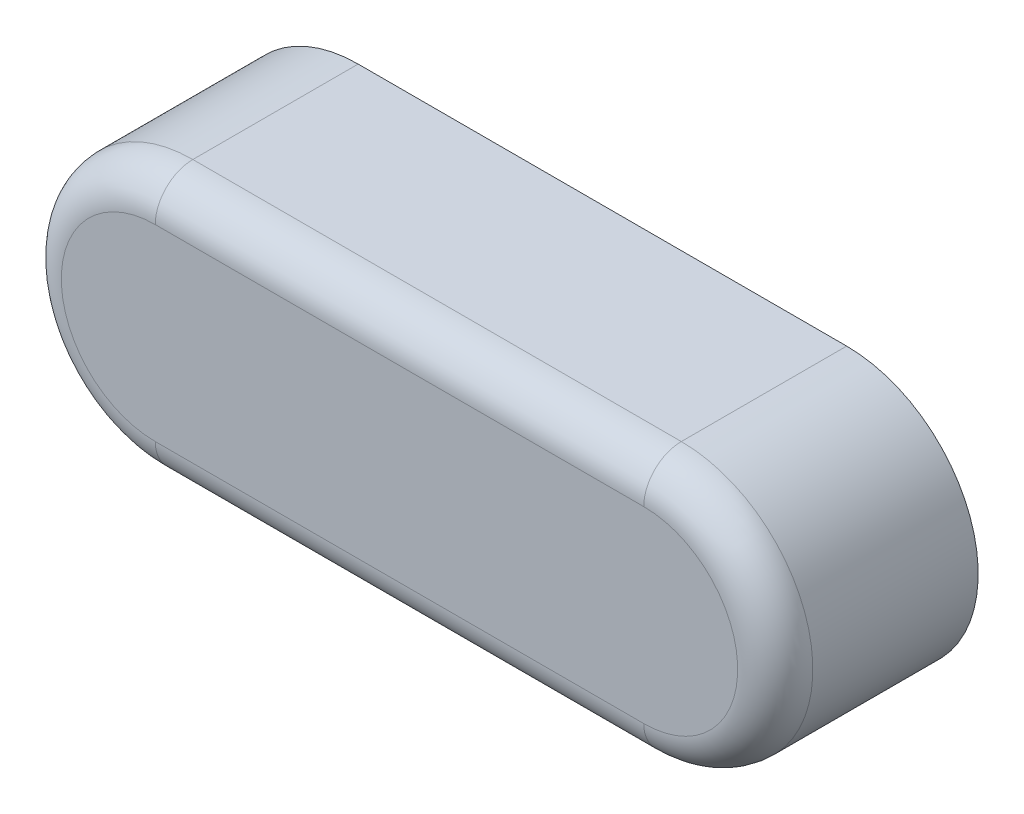
ISO-10303-21;
HEADER;
FILE_DESCRIPTION(('STEP AP214'),'2;1');
FILE_NAME('part.step','',(''),(''),'','','');
FILE_SCHEMA(('AUTOMOTIVE_DESIGN { 1 0 10303 214 1 1 1 1 }'));
ENDSEC;
DATA;
#1=APPLICATION_CONTEXT('core data for automotive mechanical design processes');
#2=APPLICATION_PROTOCOL_DEFINITION('international standard','automotive_design',2000,#1);
#3=PRODUCT_CONTEXT('',#1,'mechanical');
#4=PRODUCT('Part','Part','',(#3));
#5=PRODUCT_RELATED_PRODUCT_CATEGORY('part','',(#4));
#6=PRODUCT_DEFINITION_FORMATION('','',#4);
#7=PRODUCT_DEFINITION_CONTEXT('part definition',#1,'design');
#8=PRODUCT_DEFINITION('design','',#6,#7);
#9=PRODUCT_DEFINITION_SHAPE('','',#8);
#10=(LENGTH_UNIT() NAMED_UNIT(*) SI_UNIT(.MILLI.,.METRE.));
#11=(NAMED_UNIT(*) PLANE_ANGLE_UNIT() SI_UNIT($,.RADIAN.));
#12=(NAMED_UNIT(*) SI_UNIT($,.STERADIAN.) SOLID_ANGLE_UNIT());
#13=UNCERTAINTY_MEASURE_WITH_UNIT(LENGTH_MEASURE(1.E-05),#10,'distance_accuracy_value','');
#14=(GEOMETRIC_REPRESENTATION_CONTEXT(3) GLOBAL_UNCERTAINTY_ASSIGNED_CONTEXT((#13)) GLOBAL_UNIT_ASSIGNED_CONTEXT((#10,
#11,#12)) REPRESENTATION_CONTEXT('',''));
#15=CARTESIAN_POINT('',(0.,0.,0.));
#16=DIRECTION('',(0.,0.,1.));
#17=DIRECTION('',(1.,0.,0.));
#18=AXIS2_PLACEMENT_3D('',#15,#16,#17);
#19=CARTESIAN_POINT('',(-3.25,0.,2.7));
#20=DIRECTION('',(0.,0.,-1.));
#21=DIRECTION('',(-1.,0.,0.));
#22=AXIS2_PLACEMENT_3D('',#19,#20,#21);
#23=CYLINDRICAL_SURFACE('',#22,1.75);
#24=DIRECTION('',(0.,0.,-1.));
#25=VECTOR('',#24,1.);
#26=CARTESIAN_POINT('',(-3.25,-1.75,2.7));
#27=LINE('',#26,#25);
#28=CARTESIAN_POINT('',(-3.25,-1.75,2.2));
#29=VERTEX_POINT('',#28);
#30=CARTESIAN_POINT('',(-3.25,-1.75,0.));
#31=VERTEX_POINT('',#30);
#32=EDGE_CURVE('E68',#29,#31,#27,.T.);
#33=ORIENTED_EDGE('',*,*,#32,.F.);
#34=CARTESIAN_POINT('',(-3.25,0.,2.2));
#35=DIRECTION('',(0.,0.,1.));
#36=DIRECTION('',(1.,0.,0.));
#37=AXIS2_PLACEMENT_3D('',#34,#35,#36);
#38=CIRCLE('',#37,1.75);
#39=CARTESIAN_POINT('',(-3.25,1.75,2.2));
#40=VERTEX_POINT('',#39);
#41=EDGE_CURVE('E25',#29,#40,#38,.F.);
#42=ORIENTED_EDGE('',*,*,#41,.T.);
#43=DIRECTION('',(0.,0.,-1.));
#44=VECTOR('',#43,1.);
#45=CARTESIAN_POINT('',(-3.25,1.75,2.7));
#46=LINE('',#45,#44);
#47=CARTESIAN_POINT('',(-3.25,1.75,0.));
#48=VERTEX_POINT('',#47);
#49=EDGE_CURVE('E85',#40,#48,#46,.T.);
#50=ORIENTED_EDGE('',*,*,#49,.T.);
#51=CARTESIAN_POINT('',(-3.25,0.,0.));
#52=DIRECTION('',(0.,0.,1.));
#53=DIRECTION('',(1.,0.,0.));
#54=AXIS2_PLACEMENT_3D('',#51,#52,#53);
#55=CIRCLE('',#54,1.75);
#56=EDGE_CURVE('E81',#48,#31,#55,.T.);
#57=ORIENTED_EDGE('',*,*,#56,.T.);
#58=EDGE_LOOP('',(#33,#42,#50,#57));
#59=FACE_BOUND('',#58,.T.);
#60=ADVANCED_FACE('F16',(#59),#23,.T.);
#61=CARTESIAN_POINT('',(-3.25,-1.75,2.7));
#62=DIRECTION('',(0.,1.,0.));
#63=DIRECTION('',(0.,0.,1.));
#64=AXIS2_PLACEMENT_3D('',#61,#62,#63);
#65=PLANE('',#64);
#66=DIRECTION('',(0.,0.,-1.));
#67=VECTOR('',#66,1.);
#68=CARTESIAN_POINT('',(3.25,-1.75,2.7));
#69=LINE('',#68,#67);
#70=CARTESIAN_POINT('',(3.25,-1.75,2.2));
#71=VERTEX_POINT('',#70);
#72=CARTESIAN_POINT('',(3.25,-1.75,0.));
#73=VERTEX_POINT('',#72);
#74=EDGE_CURVE('E75',#71,#73,#69,.T.);
#75=ORIENTED_EDGE('',*,*,#74,.F.);
#76=DIRECTION('',(1.,0.,0.));
#77=VECTOR('',#76,1.);
#78=CARTESIAN_POINT('',(-3.25,-1.75,2.2));
#79=LINE('',#78,#77);
#80=EDGE_CURVE('E40',#71,#29,#79,.F.);
#81=ORIENTED_EDGE('',*,*,#80,.T.);
#82=ORIENTED_EDGE('',*,*,#32,.T.);
#83=DIRECTION('',(1.,0.,0.));
#84=VECTOR('',#83,1.);
#85=CARTESIAN_POINT('',(-3.25,-1.75,0.));
#86=LINE('',#85,#84);
#87=EDGE_CURVE('E71',#31,#73,#86,.T.);
#88=ORIENTED_EDGE('',*,*,#87,.T.);
#89=EDGE_LOOP('',(#75,#81,#82,#88));
#90=FACE_BOUND('',#89,.T.);
#91=ADVANCED_FACE('F70',(#90),#65,.F.);
#92=CARTESIAN_POINT('',(3.25,0.,2.7));
#93=DIRECTION('',(0.,0.,-1.));
#94=DIRECTION('',(-1.,0.,0.));
#95=AXIS2_PLACEMENT_3D('',#92,#93,#94);
#96=CYLINDRICAL_SURFACE('',#95,1.75);
#97=DIRECTION('',(0.,0.,-1.));
#98=VECTOR('',#97,1.);
#99=CARTESIAN_POINT('',(3.25,1.75,2.7));
#100=LINE('',#99,#98);
#101=CARTESIAN_POINT('',(3.25,1.75,2.2));
#102=VERTEX_POINT('',#101);
#103=CARTESIAN_POINT('',(3.25,1.75,0.));
#104=VERTEX_POINT('',#103);
#105=EDGE_CURVE('E95',#102,#104,#100,.T.);
#106=ORIENTED_EDGE('',*,*,#105,.F.);
#107=CARTESIAN_POINT('',(3.25,0.,2.2));
#108=DIRECTION('',(0.,0.,1.));
#109=DIRECTION('',(1.,0.,0.));
#110=AXIS2_PLACEMENT_3D('',#107,#108,#109);
#111=CIRCLE('',#110,1.75);
#112=EDGE_CURVE('E106',#102,#71,#111,.F.);
#113=ORIENTED_EDGE('',*,*,#112,.T.);
#114=ORIENTED_EDGE('',*,*,#74,.T.);
#115=CARTESIAN_POINT('',(3.25,0.,0.));
#116=DIRECTION('',(0.,0.,1.));
#117=DIRECTION('',(1.,0.,0.));
#118=AXIS2_PLACEMENT_3D('',#115,#116,#117);
#119=CIRCLE('',#118,1.75);
#120=EDGE_CURVE('E83',#73,#104,#119,.T.);
#121=ORIENTED_EDGE('',*,*,#120,.T.);
#122=EDGE_LOOP('',(#106,#113,#114,#121));
#123=FACE_BOUND('',#122,.T.);
#124=ADVANCED_FACE('F134',(#123),#96,.T.);
#125=CARTESIAN_POINT('',(-3.25,1.75,2.7));
#126=DIRECTION('',(0.,-1.,0.));
#127=DIRECTION('',(0.,0.,-1.));
#128=AXIS2_PLACEMENT_3D('',#125,#126,#127);
#129=PLANE('',#128);
#130=ORIENTED_EDGE('',*,*,#49,.F.);
#131=DIRECTION('',(-1.,0.,0.));
#132=VECTOR('',#131,1.);
#133=CARTESIAN_POINT('',(3.25,1.75,2.2));
#134=LINE('',#133,#132);
#135=EDGE_CURVE('E11',#40,#102,#134,.F.);
#136=ORIENTED_EDGE('',*,*,#135,.T.);
#137=ORIENTED_EDGE('',*,*,#105,.T.);
#138=DIRECTION('',(-1.,0.,0.));
#139=VECTOR('',#138,1.);
#140=CARTESIAN_POINT('',(-3.25,1.75,0.));
#141=LINE('',#140,#139);
#142=EDGE_CURVE('E92',#104,#48,#141,.T.);
#143=ORIENTED_EDGE('',*,*,#142,.T.);
#144=EDGE_LOOP('',(#130,#136,#137,#143));
#145=FACE_BOUND('',#144,.T.);
#146=ADVANCED_FACE('F136',(#145),#129,.F.);
#147=CARTESIAN_POINT('',(-3.25,0.,2.7));
#148=DIRECTION('',(0.,0.,1.));
#149=DIRECTION('',(1.,0.,0.));
#150=AXIS2_PLACEMENT_3D('',#147,#148,#149);
#151=PLANE('',#150);
#152=DIRECTION('',(1.,0.,0.));
#153=VECTOR('',#152,1.);
#154=CARTESIAN_POINT('',(3.25,-1.25,2.7));
#155=LINE('',#154,#153);
#156=CARTESIAN_POINT('',(-3.25,-1.25,2.7));
#157=VERTEX_POINT('',#156);
#158=CARTESIAN_POINT('',(3.25,-1.25,2.7));
#159=VERTEX_POINT('',#158);
#160=EDGE_CURVE('E101',#157,#159,#155,.T.);
#161=ORIENTED_EDGE('',*,*,#160,.T.);
#162=CARTESIAN_POINT('',(3.25,0.,2.7));
#163=DIRECTION('',(0.,0.,1.));
#164=DIRECTION('',(1.,0.,0.));
#165=AXIS2_PLACEMENT_3D('',#162,#163,#164);
#166=CIRCLE('',#165,1.25);
#167=CARTESIAN_POINT('',(3.25,1.25,2.7));
#168=VERTEX_POINT('',#167);
#169=EDGE_CURVE('E103',#159,#168,#166,.T.);
#170=ORIENTED_EDGE('',*,*,#169,.T.);
#171=DIRECTION('',(-1.,0.,0.));
#172=VECTOR('',#171,1.);
#173=CARTESIAN_POINT('',(-3.25,1.25,2.7));
#174=LINE('',#173,#172);
#175=CARTESIAN_POINT('',(-3.25,1.25,2.7));
#176=VERTEX_POINT('',#175);
#177=EDGE_CURVE('E74',#168,#176,#174,.T.);
#178=ORIENTED_EDGE('',*,*,#177,.T.);
#179=CARTESIAN_POINT('',(-3.25,0.,2.7));
#180=DIRECTION('',(0.,0.,1.));
#181=DIRECTION('',(1.,0.,0.));
#182=AXIS2_PLACEMENT_3D('',#179,#180,#181);
#183=CIRCLE('',#182,1.25);
#184=EDGE_CURVE('E99',#176,#157,#183,.T.);
#185=ORIENTED_EDGE('',*,*,#184,.T.);
#186=EDGE_LOOP('',(#161,#170,#178,#185));
#187=FACE_BOUND('',#186,.T.);
#188=ADVANCED_FACE('F126',(#187),#151,.T.);
#189=CARTESIAN_POINT('',(-3.25,0.,0.));
#190=DIRECTION('',(0.,0.,1.));
#191=DIRECTION('',(1.,0.,0.));
#192=AXIS2_PLACEMENT_3D('',#189,#190,#191);
#193=PLANE('',#192);
#194=ORIENTED_EDGE('',*,*,#56,.F.);
#195=ORIENTED_EDGE('',*,*,#142,.F.);
#196=ORIENTED_EDGE('',*,*,#120,.F.);
#197=ORIENTED_EDGE('',*,*,#87,.F.);
#198=EDGE_LOOP('',(#194,#195,#196,#197));
#199=FACE_BOUND('',#198,.T.);
#200=ADVANCED_FACE('F79',(#199),#193,.F.);
#201=CARTESIAN_POINT('',(-3.25,0.,2.2));
#202=DIRECTION('',(0.,0.,1.));
#203=DIRECTION('',(1.,0.,0.));
#204=AXIS2_PLACEMENT_3D('',#201,#202,#203);
#205=TOROIDAL_SURFACE('',#204,1.25,0.5);
#206=CARTESIAN_POINT('',(-3.25,1.25,2.2));
#207=DIRECTION('',(1.,0.,0.));
#208=DIRECTION('',(0.,0.,-1.));
#209=AXIS2_PLACEMENT_3D('',#206,#207,#208);
#210=CIRCLE('',#209,0.5);
#211=EDGE_CURVE('E89',#40,#176,#210,.T.);
#212=ORIENTED_EDGE('',*,*,#211,.F.);
#213=ORIENTED_EDGE('',*,*,#41,.F.);
#214=CARTESIAN_POINT('',(-3.25,-1.25,2.2));
#215=DIRECTION('',(1.,0.,0.));
#216=DIRECTION('',(0.,0.,-1.));
#217=AXIS2_PLACEMENT_3D('',#214,#215,#216);
#218=CIRCLE('',#217,0.5);
#219=EDGE_CURVE('E20',#157,#29,#218,.T.);
#220=ORIENTED_EDGE('',*,*,#219,.F.);
#221=ORIENTED_EDGE('',*,*,#184,.F.);
#222=EDGE_LOOP('',(#212,#213,#220,#221));
#223=FACE_BOUND('',#222,.T.);
#224=ADVANCED_FACE('F18',(#223),#205,.T.);
#225=CARTESIAN_POINT('',(-3.25,-1.25,2.2));
#226=DIRECTION('',(-1.,0.,0.));
#227=DIRECTION('',(0.,0.,1.));
#228=AXIS2_PLACEMENT_3D('',#225,#226,#227);
#229=CYLINDRICAL_SURFACE('',#228,0.5);
#230=ORIENTED_EDGE('',*,*,#219,.T.);
#231=ORIENTED_EDGE('',*,*,#80,.F.);
#232=CARTESIAN_POINT('',(3.25,-1.25,2.2));
#233=DIRECTION('',(1.,0.,0.));
#234=DIRECTION('',(0.,0.,-1.));
#235=AXIS2_PLACEMENT_3D('',#232,#233,#234);
#236=CIRCLE('',#235,0.5);
#237=EDGE_CURVE('E113',#159,#71,#236,.T.);
#238=ORIENTED_EDGE('',*,*,#237,.F.);
#239=ORIENTED_EDGE('',*,*,#160,.F.);
#240=EDGE_LOOP('',(#230,#231,#238,#239));
#241=FACE_BOUND('',#240,.T.);
#242=ADVANCED_FACE('F159',(#241),#229,.T.);
#243=CARTESIAN_POINT('',(-3.25,1.25,2.2));
#244=DIRECTION('',(1.,0.,0.));
#245=DIRECTION('',(0.,0.,-1.));
#246=AXIS2_PLACEMENT_3D('',#243,#244,#245);
#247=CYLINDRICAL_SURFACE('',#246,0.5);
#248=ORIENTED_EDGE('',*,*,#211,.T.);
#249=ORIENTED_EDGE('',*,*,#177,.F.);
#250=CARTESIAN_POINT('',(3.25,1.25,2.2));
#251=DIRECTION('',(1.,0.,0.));
#252=DIRECTION('',(0.,0.,-1.));
#253=AXIS2_PLACEMENT_3D('',#250,#251,#252);
#254=CIRCLE('',#253,0.5);
#255=EDGE_CURVE('E111',#102,#168,#254,.T.);
#256=ORIENTED_EDGE('',*,*,#255,.F.);
#257=ORIENTED_EDGE('',*,*,#135,.F.);
#258=EDGE_LOOP('',(#248,#249,#256,#257));
#259=FACE_BOUND('',#258,.T.);
#260=ADVANCED_FACE('F119',(#259),#247,.T.);
#261=CARTESIAN_POINT('',(3.25,0.,2.2));
#262=DIRECTION('',(0.,0.,1.));
#263=DIRECTION('',(1.,0.,0.));
#264=AXIS2_PLACEMENT_3D('',#261,#262,#263);
#265=TOROIDAL_SURFACE('',#264,1.25,0.5);
#266=ORIENTED_EDGE('',*,*,#237,.T.);
#267=ORIENTED_EDGE('',*,*,#112,.F.);
#268=ORIENTED_EDGE('',*,*,#255,.T.);
#269=ORIENTED_EDGE('',*,*,#169,.F.);
#270=EDGE_LOOP('',(#266,#267,#268,#269));
#271=FACE_BOUND('',#270,.T.);
#272=ADVANCED_FACE('F130',(#271),#265,.T.);
#273=CLOSED_SHELL('',(#60,#91,#124,#146,#188,#200,#224,#242,#260,#272));
#274=MANIFOLD_SOLID_BREP('B1',#273);
#275=ADVANCED_BREP_SHAPE_REPRESENTATION('',(#18,#274),#14);
#276=SHAPE_DEFINITION_REPRESENTATION(#9,#275);
ENDSEC;
END-ISO-10303-21;
